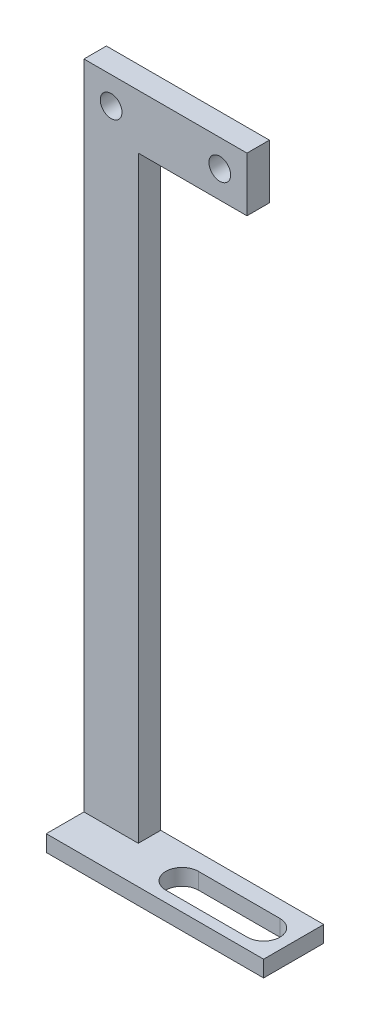
ISO-10303-21;
HEADER;
FILE_DESCRIPTION(('STEP AP214'),'2;1');
FILE_NAME('part.step','',(''),(''),'','','');
FILE_SCHEMA(('AUTOMOTIVE_DESIGN { 1 0 10303 214 1 1 1 1 }'));
ENDSEC;
DATA;
#1=APPLICATION_CONTEXT('core data for automotive mechanical design processes');
#2=APPLICATION_PROTOCOL_DEFINITION('international standard','automotive_design',2000,#1);
#3=PRODUCT_CONTEXT('',#1,'mechanical');
#4=PRODUCT('Part','Part','',(#3));
#5=PRODUCT_RELATED_PRODUCT_CATEGORY('part','',(#4));
#6=PRODUCT_DEFINITION_FORMATION('','',#4);
#7=PRODUCT_DEFINITION_CONTEXT('part definition',#1,'design');
#8=PRODUCT_DEFINITION('design','',#6,#7);
#9=PRODUCT_DEFINITION_SHAPE('','',#8);
#10=(LENGTH_UNIT() NAMED_UNIT(*) SI_UNIT(.MILLI.,.METRE.));
#11=(NAMED_UNIT(*) PLANE_ANGLE_UNIT() SI_UNIT($,.RADIAN.));
#12=(NAMED_UNIT(*) SI_UNIT($,.STERADIAN.) SOLID_ANGLE_UNIT());
#13=UNCERTAINTY_MEASURE_WITH_UNIT(LENGTH_MEASURE(1.E-05),#10,'distance_accuracy_value','');
#14=(GEOMETRIC_REPRESENTATION_CONTEXT(3) GLOBAL_UNCERTAINTY_ASSIGNED_CONTEXT((#13)) GLOBAL_UNIT_ASSIGNED_CONTEXT((#10,
#11,#12)) REPRESENTATION_CONTEXT('',''));
#15=CARTESIAN_POINT('',(0.,0.,0.));
#16=DIRECTION('',(0.,0.,1.));
#17=DIRECTION('',(1.,0.,0.));
#18=AXIS2_PLACEMENT_3D('',#15,#16,#17);
#19=CARTESIAN_POINT('',(-5.,0.,3.06470199150335));
#20=DIRECTION('',(1.,0.,0.));
#21=DIRECTION('',(0.,0.,-1.));
#22=AXIS2_PLACEMENT_3D('',#19,#20,#21);
#23=PLANE('',#22);
#24=DIRECTION('',(0.,1.,0.));
#25=VECTOR('',#24,1.);
#26=CARTESIAN_POINT('',(-5.,0.,-1.06470199150335));
#27=LINE('',#26,#25);
#28=CARTESIAN_POINT('',(-5.,3.,-1.06470199150335));
#29=VERTEX_POINT('',#28);
#30=CARTESIAN_POINT('',(-5.,113.,-1.06470199150335));
#31=VERTEX_POINT('',#30);
#32=EDGE_CURVE('E257',#29,#31,#27,.T.);
#33=ORIENTED_EDGE('',*,*,#32,.T.);
#34=DIRECTION('',(0.,0.,-1.));
#35=VECTOR('',#34,1.);
#36=CARTESIAN_POINT('',(-5.,113.,3.06470199150335));
#37=LINE('',#36,#35);
#38=CARTESIAN_POINT('',(-5.,113.,3.06470199150335));
#39=VERTEX_POINT('',#38);
#40=EDGE_CURVE('E212',#39,#31,#37,.T.);
#41=ORIENTED_EDGE('',*,*,#40,.F.);
#42=DIRECTION('',(0.,1.,0.));
#43=VECTOR('',#42,1.);
#44=CARTESIAN_POINT('',(-5.,0.,3.06470199150335));
#45=LINE('',#44,#43);
#46=CARTESIAN_POINT('',(-5.,3.,3.06470199150335));
#47=VERTEX_POINT('',#46);
#48=EDGE_CURVE('E258',#47,#39,#45,.T.);
#49=ORIENTED_EDGE('',*,*,#48,.F.);
#50=DIRECTION('',(0.,0.,-1.));
#51=VECTOR('',#50,1.);
#52=CARTESIAN_POINT('',(-5.,3.,0.));
#53=LINE('',#52,#51);
#54=EDGE_CURVE('E51',#47,#29,#53,.T.);
#55=ORIENTED_EDGE('',*,*,#54,.T.);
#56=EDGE_LOOP('',(#33,#41,#49,#55));
#57=FACE_BOUND('',#56,.T.);
#58=ADVANCED_FACE('F35',(#57),#23,.T.);
#59=CARTESIAN_POINT('',(0.,3.,10.));
#60=DIRECTION('',(0.,0.,-1.));
#61=DIRECTION('',(-1.,0.,0.));
#62=AXIS2_PLACEMENT_3D('',#59,#60,#61);
#63=PLANE('',#62);
#64=DIRECTION('',(1.,0.,0.));
#65=VECTOR('',#64,1.);
#66=CARTESIAN_POINT('',(0.,0.,10.));
#67=LINE('',#66,#65);
#68=CARTESIAN_POINT('',(-15.,0.,10.));
#69=VERTEX_POINT('',#68);
#70=CARTESIAN_POINT('',(25.,0.,10.));
#71=VERTEX_POINT('',#70);
#72=EDGE_CURVE('E142',#69,#71,#67,.T.);
#73=ORIENTED_EDGE('',*,*,#72,.T.);
#74=DIRECTION('',(0.,-1.,0.));
#75=VECTOR('',#74,1.);
#76=CARTESIAN_POINT('',(25.,3.,10.));
#77=LINE('',#76,#75);
#78=CARTESIAN_POINT('',(25.,3.,10.));
#79=VERTEX_POINT('',#78);
#80=EDGE_CURVE('E11',#79,#71,#77,.T.);
#81=ORIENTED_EDGE('',*,*,#80,.F.);
#82=DIRECTION('',(1.,0.,0.));
#83=VECTOR('',#82,1.);
#84=CARTESIAN_POINT('',(0.,3.,10.));
#85=LINE('',#84,#83);
#86=CARTESIAN_POINT('',(-15.,3.,10.));
#87=VERTEX_POINT('',#86);
#88=EDGE_CURVE('E119',#87,#79,#85,.T.);
#89=ORIENTED_EDGE('',*,*,#88,.F.);
#90=DIRECTION('',(0.,1.,0.));
#91=VECTOR('',#90,1.);
#92=CARTESIAN_POINT('',(-15.,0.,10.));
#93=LINE('',#92,#91);
#94=EDGE_CURVE('E136',#69,#87,#93,.T.);
#95=ORIENTED_EDGE('',*,*,#94,.F.);
#96=EDGE_LOOP('',(#73,#81,#89,#95));
#97=FACE_BOUND('',#96,.T.);
#98=ADVANCED_FACE('F165',(#97),#63,.F.);
#99=CARTESIAN_POINT('',(25.,3.,0.));
#100=DIRECTION('',(-1.,0.,0.));
#101=DIRECTION('',(0.,0.,1.));
#102=AXIS2_PLACEMENT_3D('',#99,#100,#101);
#103=PLANE('',#102);
#104=DIRECTION('',(0.,0.,-1.));
#105=VECTOR('',#104,1.);
#106=CARTESIAN_POINT('',(25.,0.,0.));
#107=LINE('',#106,#105);
#108=CARTESIAN_POINT('',(25.,0.,-1.06470199150335));
#109=VERTEX_POINT('',#108);
#110=EDGE_CURVE('E85',#71,#109,#107,.T.);
#111=ORIENTED_EDGE('',*,*,#110,.T.);
#112=DIRECTION('',(0.,1.,0.));
#113=VECTOR('',#112,1.);
#114=CARTESIAN_POINT('',(25.,3.,-1.06470199150335));
#115=LINE('',#114,#113);
#116=CARTESIAN_POINT('',(25.,3.,-1.06470199150335));
#117=VERTEX_POINT('',#116);
#118=EDGE_CURVE('E235',#109,#117,#115,.T.);
#119=ORIENTED_EDGE('',*,*,#118,.T.);
#120=DIRECTION('',(0.,0.,-1.));
#121=VECTOR('',#120,1.);
#122=CARTESIAN_POINT('',(25.,3.,0.));
#123=LINE('',#122,#121);
#124=EDGE_CURVE('E59',#79,#117,#123,.T.);
#125=ORIENTED_EDGE('',*,*,#124,.F.);
#126=ORIENTED_EDGE('',*,*,#80,.T.);
#127=EDGE_LOOP('',(#111,#119,#125,#126));
#128=FACE_BOUND('',#127,.T.);
#129=ADVANCED_FACE('F171',(#128),#103,.F.);
#130=CARTESIAN_POINT('',(20.,3.,5.));
#131=DIRECTION('',(0.,-1.,0.));
#132=DIRECTION('',(0.,0.,-1.));
#133=AXIS2_PLACEMENT_3D('',#130,#131,#132);
#134=CYLINDRICAL_SURFACE('',#133,3.);
#135=CARTESIAN_POINT('',(20.,0.,5.));
#136=DIRECTION('',(0.,1.,0.));
#137=DIRECTION('',(0.,0.,1.));
#138=AXIS2_PLACEMENT_3D('',#135,#136,#137);
#139=CIRCLE('',#138,3.);
#140=CARTESIAN_POINT('',(20.,0.,8.));
#141=VERTEX_POINT('',#140);
#142=CARTESIAN_POINT('',(20.,0.,2.));
#143=VERTEX_POINT('',#142);
#144=EDGE_CURVE('E132',#141,#143,#139,.T.);
#145=ORIENTED_EDGE('',*,*,#144,.F.);
#146=DIRECTION('',(0.,-1.,0.));
#147=VECTOR('',#146,1.);
#148=CARTESIAN_POINT('',(20.,3.,8.));
#149=LINE('',#148,#147);
#150=CARTESIAN_POINT('',(20.,3.,8.));
#151=VERTEX_POINT('',#150);
#152=EDGE_CURVE('E39',#151,#141,#149,.T.);
#153=ORIENTED_EDGE('',*,*,#152,.F.);
#154=CARTESIAN_POINT('',(20.,3.,5.));
#155=DIRECTION('',(0.,1.,0.));
#156=DIRECTION('',(0.,0.,1.));
#157=AXIS2_PLACEMENT_3D('',#154,#155,#156);
#158=CIRCLE('',#157,3.);
#159=CARTESIAN_POINT('',(20.,3.,2.));
#160=VERTEX_POINT('',#159);
#161=EDGE_CURVE('E126',#151,#160,#158,.T.);
#162=ORIENTED_EDGE('',*,*,#161,.T.);
#163=DIRECTION('',(0.,-1.,0.));
#164=VECTOR('',#163,1.);
#165=CARTESIAN_POINT('',(20.,3.,2.));
#166=LINE('',#165,#164);
#167=EDGE_CURVE('E113',#160,#143,#166,.T.);
#168=ORIENTED_EDGE('',*,*,#167,.T.);
#169=EDGE_LOOP('',(#145,#153,#162,#168));
#170=FACE_BOUND('',#169,.T.);
#171=ADVANCED_FACE('F37',(#170),#134,.F.);
#172=CARTESIAN_POINT('',(0.,3.,8.));
#173=DIRECTION('',(0.,0.,-1.));
#174=DIRECTION('',(-1.,0.,0.));
#175=AXIS2_PLACEMENT_3D('',#172,#173,#174);
#176=PLANE('',#175);
#177=DIRECTION('',(1.,0.,0.));
#178=VECTOR('',#177,1.);
#179=CARTESIAN_POINT('',(0.,0.,8.));
#180=LINE('',#179,#178);
#181=CARTESIAN_POINT('',(5.,0.,8.));
#182=VERTEX_POINT('',#181);
#183=EDGE_CURVE('E135',#182,#141,#180,.T.);
#184=ORIENTED_EDGE('',*,*,#183,.F.);
#185=DIRECTION('',(0.,-1.,0.));
#186=VECTOR('',#185,1.);
#187=CARTESIAN_POINT('',(5.,3.,8.));
#188=LINE('',#187,#186);
#189=CARTESIAN_POINT('',(5.,3.,8.));
#190=VERTEX_POINT('',#189);
#191=EDGE_CURVE('E112',#190,#182,#188,.T.);
#192=ORIENTED_EDGE('',*,*,#191,.F.);
#193=DIRECTION('',(1.,0.,0.));
#194=VECTOR('',#193,1.);
#195=CARTESIAN_POINT('',(0.,3.,8.));
#196=LINE('',#195,#194);
#197=EDGE_CURVE('E124',#190,#151,#196,.T.);
#198=ORIENTED_EDGE('',*,*,#197,.T.);
#199=ORIENTED_EDGE('',*,*,#152,.T.);
#200=EDGE_LOOP('',(#184,#192,#198,#199));
#201=FACE_BOUND('',#200,.T.);
#202=ADVANCED_FACE('F148',(#201),#176,.T.);
#203=CARTESIAN_POINT('',(5.,3.,5.));
#204=DIRECTION('',(0.,-1.,0.));
#205=DIRECTION('',(0.,0.,-1.));
#206=AXIS2_PLACEMENT_3D('',#203,#204,#205);
#207=CYLINDRICAL_SURFACE('',#206,3.);
#208=CARTESIAN_POINT('',(5.,0.,5.));
#209=DIRECTION('',(0.,1.,0.));
#210=DIRECTION('',(0.,0.,1.));
#211=AXIS2_PLACEMENT_3D('',#208,#209,#210);
#212=CIRCLE('',#211,3.);
#213=CARTESIAN_POINT('',(5.,0.,2.));
#214=VERTEX_POINT('',#213);
#215=EDGE_CURVE('E108',#214,#182,#212,.T.);
#216=ORIENTED_EDGE('',*,*,#215,.F.);
#217=DIRECTION('',(0.,-1.,0.));
#218=VECTOR('',#217,1.);
#219=CARTESIAN_POINT('',(5.,3.,2.));
#220=LINE('',#219,#218);
#221=CARTESIAN_POINT('',(5.,3.,2.));
#222=VERTEX_POINT('',#221);
#223=EDGE_CURVE('E102',#222,#214,#220,.T.);
#224=ORIENTED_EDGE('',*,*,#223,.F.);
#225=CARTESIAN_POINT('',(5.,3.,5.));
#226=DIRECTION('',(0.,1.,0.));
#227=DIRECTION('',(0.,0.,1.));
#228=AXIS2_PLACEMENT_3D('',#225,#226,#227);
#229=CIRCLE('',#228,3.);
#230=EDGE_CURVE('E106',#222,#190,#229,.T.);
#231=ORIENTED_EDGE('',*,*,#230,.T.);
#232=ORIENTED_EDGE('',*,*,#191,.T.);
#233=EDGE_LOOP('',(#216,#224,#231,#232));
#234=FACE_BOUND('',#233,.T.);
#235=ADVANCED_FACE('F104',(#234),#207,.F.);
#236=CARTESIAN_POINT('',(0.,3.,2.));
#237=DIRECTION('',(0.,0.,-1.));
#238=DIRECTION('',(-1.,0.,0.));
#239=AXIS2_PLACEMENT_3D('',#236,#237,#238);
#240=PLANE('',#239);
#241=DIRECTION('',(1.,0.,0.));
#242=VECTOR('',#241,1.);
#243=CARTESIAN_POINT('',(0.,0.,2.));
#244=LINE('',#243,#242);
#245=EDGE_CURVE('E140',#214,#143,#244,.T.);
#246=ORIENTED_EDGE('',*,*,#245,.T.);
#247=ORIENTED_EDGE('',*,*,#167,.F.);
#248=DIRECTION('',(1.,0.,0.));
#249=VECTOR('',#248,1.);
#250=CARTESIAN_POINT('',(0.,3.,2.));
#251=LINE('',#250,#249);
#252=EDGE_CURVE('E116',#222,#160,#251,.T.);
#253=ORIENTED_EDGE('',*,*,#252,.F.);
#254=ORIENTED_EDGE('',*,*,#223,.T.);
#255=EDGE_LOOP('',(#246,#247,#253,#254));
#256=FACE_BOUND('',#255,.T.);
#257=ADVANCED_FACE('F117',(#256),#240,.F.);
#258=CARTESIAN_POINT('',(0.,3.,0.));
#259=DIRECTION('',(0.,1.,0.));
#260=DIRECTION('',(0.,0.,1.));
#261=AXIS2_PLACEMENT_3D('',#258,#259,#260);
#262=PLANE('',#261);
#263=ORIENTED_EDGE('',*,*,#54,.F.);
#264=DIRECTION('',(1.,0.,0.));
#265=VECTOR('',#264,1.);
#266=CARTESIAN_POINT('',(0.,3.,3.06470199150335));
#267=LINE('',#266,#265);
#268=CARTESIAN_POINT('',(-15.,3.,3.06470199150335));
#269=VERTEX_POINT('',#268);
#270=EDGE_CURVE('E261',#269,#47,#267,.T.);
#271=ORIENTED_EDGE('',*,*,#270,.F.);
#272=DIRECTION('',(0.,0.,1.));
#273=VECTOR('',#272,1.);
#274=CARTESIAN_POINT('',(-15.,3.,0.));
#275=LINE('',#274,#273);
#276=EDGE_CURVE('E271',#269,#87,#275,.T.);
#277=ORIENTED_EDGE('',*,*,#276,.T.);
#278=ORIENTED_EDGE('',*,*,#88,.T.);
#279=ORIENTED_EDGE('',*,*,#124,.T.);
#280=DIRECTION('',(-1.,0.,0.));
#281=VECTOR('',#280,1.);
#282=CARTESIAN_POINT('',(25.,3.,-1.06470199150335));
#283=LINE('',#282,#281);
#284=EDGE_CURVE('E237',#117,#29,#283,.T.);
#285=ORIENTED_EDGE('',*,*,#284,.T.);
#286=EDGE_LOOP('',(#263,#271,#277,#278,#279,#285));
#287=FACE_BOUND('',#286,.T.);
#288=ORIENTED_EDGE('',*,*,#161,.F.);
#289=ORIENTED_EDGE('',*,*,#197,.F.);
#290=ORIENTED_EDGE('',*,*,#230,.F.);
#291=ORIENTED_EDGE('',*,*,#252,.T.);
#292=EDGE_LOOP('',(#288,#289,#290,#291));
#293=FACE_BOUND('',#292,.T.);
#294=ADVANCED_FACE('F122',(#287,#293),#262,.T.);
#295=CARTESIAN_POINT('',(0.,0.,0.));
#296=DIRECTION('',(0.,1.,0.));
#297=DIRECTION('',(0.,0.,1.));
#298=AXIS2_PLACEMENT_3D('',#295,#296,#297);
#299=PLANE('',#298);
#300=DIRECTION('',(0.,0.,1.));
#301=VECTOR('',#300,1.);
#302=CARTESIAN_POINT('',(-15.,0.,0.));
#303=LINE('',#302,#301);
#304=CARTESIAN_POINT('',(-15.,0.,-1.06470199150335));
#305=VERTEX_POINT('',#304);
#306=EDGE_CURVE('E272',#305,#69,#303,.T.);
#307=ORIENTED_EDGE('',*,*,#306,.F.);
#308=DIRECTION('',(-1.,0.,0.));
#309=VECTOR('',#308,1.);
#310=CARTESIAN_POINT('',(-5.,0.,-1.06470199150335));
#311=LINE('',#310,#309);
#312=EDGE_CURVE('E254',#109,#305,#311,.T.);
#313=ORIENTED_EDGE('',*,*,#312,.F.);
#314=ORIENTED_EDGE('',*,*,#110,.F.);
#315=ORIENTED_EDGE('',*,*,#72,.F.);
#316=EDGE_LOOP('',(#307,#313,#314,#315));
#317=FACE_BOUND('',#316,.T.);
#318=ORIENTED_EDGE('',*,*,#144,.T.);
#319=ORIENTED_EDGE('',*,*,#245,.F.);
#320=ORIENTED_EDGE('',*,*,#215,.T.);
#321=ORIENTED_EDGE('',*,*,#183,.T.);
#322=EDGE_LOOP('',(#318,#319,#320,#321));
#323=FACE_BOUND('',#322,.T.);
#324=ADVANCED_FACE('F150',(#317,#323),#299,.F.);
#325=CARTESIAN_POINT('',(-15.,0.,0.));
#326=DIRECTION('',(-1.,0.,0.));
#327=DIRECTION('',(0.,0.,1.));
#328=AXIS2_PLACEMENT_3D('',#325,#326,#327);
#329=PLANE('',#328);
#330=ORIENTED_EDGE('',*,*,#276,.F.);
#331=DIRECTION('',(0.,1.,0.));
#332=VECTOR('',#331,1.);
#333=CARTESIAN_POINT('',(-15.,0.,3.06470199150335));
#334=LINE('',#333,#332);
#335=CARTESIAN_POINT('',(-15.,123.,3.06470199150335));
#336=VERTEX_POINT('',#335);
#337=EDGE_CURVE('E262',#269,#336,#334,.T.);
#338=ORIENTED_EDGE('',*,*,#337,.T.);
#339=DIRECTION('',(0.,0.,1.));
#340=VECTOR('',#339,1.);
#341=CARTESIAN_POINT('',(-15.,123.,-1.06470199150335));
#342=LINE('',#341,#340);
#343=CARTESIAN_POINT('',(-15.,123.,-1.06470199150335));
#344=VERTEX_POINT('',#343);
#345=EDGE_CURVE('E248',#344,#336,#342,.T.);
#346=ORIENTED_EDGE('',*,*,#345,.F.);
#347=DIRECTION('',(0.,1.,0.));
#348=VECTOR('',#347,1.);
#349=CARTESIAN_POINT('',(-15.,0.,-1.06470199150335));
#350=LINE('',#349,#348);
#351=EDGE_CURVE('E265',#305,#344,#350,.T.);
#352=ORIENTED_EDGE('',*,*,#351,.F.);
#353=ORIENTED_EDGE('',*,*,#306,.T.);
#354=ORIENTED_EDGE('',*,*,#94,.T.);
#355=EDGE_LOOP('',(#330,#338,#346,#352,#353,#354));
#356=FACE_BOUND('',#355,.T.);
#357=ADVANCED_FACE('F152',(#356),#329,.T.);
#358=CARTESIAN_POINT('',(-15.,0.,3.06470199150335));
#359=DIRECTION('',(0.,0.,1.));
#360=DIRECTION('',(1.,0.,0.));
#361=AXIS2_PLACEMENT_3D('',#358,#359,#360);
#362=PLANE('',#361);
#363=CARTESIAN_POINT('',(10.,118.,3.06470199150335));
#364=DIRECTION('',(0.,0.,1.));
#365=DIRECTION('',(1.,0.,0.));
#366=AXIS2_PLACEMENT_3D('',#363,#364,#365);
#367=CIRCLE('',#366,2.);
#368=CARTESIAN_POINT('',(12.,118.,3.06470199150335));
#369=VERTEX_POINT('',#368);
#370=EDGE_CURVE('E210',#369,#369,#367,.T.);
#371=ORIENTED_EDGE('',*,*,#370,.F.);
#372=EDGE_LOOP('',(#371));
#373=FACE_BOUND('',#372,.T.);
#374=CARTESIAN_POINT('',(-10.,118.,3.06470199150335));
#375=DIRECTION('',(0.,0.,1.));
#376=DIRECTION('',(1.,0.,0.));
#377=AXIS2_PLACEMENT_3D('',#374,#375,#376);
#378=CIRCLE('',#377,2.);
#379=CARTESIAN_POINT('',(-8.,118.,3.06470199150335));
#380=VERTEX_POINT('',#379);
#381=EDGE_CURVE('E239',#380,#380,#378,.T.);
#382=ORIENTED_EDGE('',*,*,#381,.F.);
#383=EDGE_LOOP('',(#382));
#384=FACE_BOUND('',#383,.T.);
#385=ORIENTED_EDGE('',*,*,#337,.F.);
#386=ORIENTED_EDGE('',*,*,#270,.T.);
#387=ORIENTED_EDGE('',*,*,#48,.T.);
#388=DIRECTION('',(-1.,0.,0.));
#389=VECTOR('',#388,1.);
#390=CARTESIAN_POINT('',(15.,113.,3.06470199150335));
#391=LINE('',#390,#389);
#392=CARTESIAN_POINT('',(15.,113.,3.06470199150335));
#393=VERTEX_POINT('',#392);
#394=EDGE_CURVE('E232',#393,#39,#391,.T.);
#395=ORIENTED_EDGE('',*,*,#394,.F.);
#396=DIRECTION('',(0.,-1.,0.));
#397=VECTOR('',#396,1.);
#398=CARTESIAN_POINT('',(15.,123.,3.06470199150335));
#399=LINE('',#398,#397);
#400=CARTESIAN_POINT('',(15.,123.,3.06470199150335));
#401=VERTEX_POINT('',#400);
#402=EDGE_CURVE('E218',#401,#393,#399,.T.);
#403=ORIENTED_EDGE('',*,*,#402,.F.);
#404=DIRECTION('',(1.,0.,0.));
#405=VECTOR('',#404,1.);
#406=CARTESIAN_POINT('',(-15.,123.,3.06470199150335));
#407=LINE('',#406,#405);
#408=EDGE_CURVE('E251',#336,#401,#407,.T.);
#409=ORIENTED_EDGE('',*,*,#408,.F.);
#410=EDGE_LOOP('',(#385,#386,#387,#395,#403,#409));
#411=FACE_BOUND('',#410,.T.);
#412=ADVANCED_FACE('F158',(#373,#384,#411),#362,.T.);
#413=CARTESIAN_POINT('',(-5.,0.,-1.06470199150335));
#414=DIRECTION('',(0.,0.,-1.));
#415=DIRECTION('',(-1.,0.,0.));
#416=AXIS2_PLACEMENT_3D('',#413,#414,#415);
#417=PLANE('',#416);
#418=CARTESIAN_POINT('',(10.,118.,-1.06470199150335));
#419=DIRECTION('',(0.,0.,1.));
#420=DIRECTION('',(1.,0.,0.));
#421=AXIS2_PLACEMENT_3D('',#418,#419,#420);
#422=CIRCLE('',#421,2.);
#423=CARTESIAN_POINT('',(12.,118.,-1.06470199150335));
#424=VERTEX_POINT('',#423);
#425=EDGE_CURVE('E207',#424,#424,#422,.T.);
#426=ORIENTED_EDGE('',*,*,#425,.T.);
#427=EDGE_LOOP('',(#426));
#428=FACE_BOUND('',#427,.T.);
#429=CARTESIAN_POINT('',(-10.,118.,-1.06470199150335));
#430=DIRECTION('',(0.,0.,1.));
#431=DIRECTION('',(1.,0.,0.));
#432=AXIS2_PLACEMENT_3D('',#429,#430,#431);
#433=CIRCLE('',#432,2.);
#434=CARTESIAN_POINT('',(-8.,118.,-1.06470199150335));
#435=VERTEX_POINT('',#434);
#436=EDGE_CURVE('E240',#435,#435,#433,.T.);
#437=ORIENTED_EDGE('',*,*,#436,.T.);
#438=EDGE_LOOP('',(#437));
#439=FACE_BOUND('',#438,.T.);
#440=ORIENTED_EDGE('',*,*,#351,.T.);
#441=DIRECTION('',(-1.,0.,0.));
#442=VECTOR('',#441,1.);
#443=CARTESIAN_POINT('',(-5.,123.,-1.06470199150335));
#444=LINE('',#443,#442);
#445=CARTESIAN_POINT('',(15.,123.,-1.06470199150335));
#446=VERTEX_POINT('',#445);
#447=EDGE_CURVE('E243',#446,#344,#444,.T.);
#448=ORIENTED_EDGE('',*,*,#447,.F.);
#449=DIRECTION('',(0.,1.,0.));
#450=VECTOR('',#449,1.);
#451=CARTESIAN_POINT('',(15.,113.,-1.06470199150335));
#452=LINE('',#451,#450);
#453=CARTESIAN_POINT('',(15.,113.,-1.06470199150335));
#454=VERTEX_POINT('',#453);
#455=EDGE_CURVE('E224',#454,#446,#452,.T.);
#456=ORIENTED_EDGE('',*,*,#455,.F.);
#457=DIRECTION('',(-1.,0.,0.));
#458=VECTOR('',#457,1.);
#459=CARTESIAN_POINT('',(15.,113.,-1.06470199150335));
#460=LINE('',#459,#458);
#461=EDGE_CURVE('E227',#454,#31,#460,.T.);
#462=ORIENTED_EDGE('',*,*,#461,.T.);
#463=ORIENTED_EDGE('',*,*,#32,.F.);
#464=ORIENTED_EDGE('',*,*,#284,.F.);
#465=ORIENTED_EDGE('',*,*,#118,.F.);
#466=ORIENTED_EDGE('',*,*,#312,.T.);
#467=EDGE_LOOP('',(#440,#448,#456,#462,#463,#464,#465,#466));
#468=FACE_BOUND('',#467,.T.);
#469=ADVANCED_FACE('F176',(#428,#439,#468),#417,.T.);
#470=CARTESIAN_POINT('',(0.,123.,0.));
#471=DIRECTION('',(0.,1.,0.));
#472=DIRECTION('',(0.,0.,1.));
#473=AXIS2_PLACEMENT_3D('',#470,#471,#472);
#474=PLANE('',#473);
#475=ORIENTED_EDGE('',*,*,#408,.T.);
#476=DIRECTION('',(0.,0.,1.));
#477=VECTOR('',#476,1.);
#478=CARTESIAN_POINT('',(15.,123.,-1.06470199150335));
#479=LINE('',#478,#477);
#480=EDGE_CURVE('E215',#446,#401,#479,.T.);
#481=ORIENTED_EDGE('',*,*,#480,.F.);
#482=ORIENTED_EDGE('',*,*,#447,.T.);
#483=ORIENTED_EDGE('',*,*,#345,.T.);
#484=EDGE_LOOP('',(#475,#481,#482,#483));
#485=FACE_BOUND('',#484,.T.);
#486=ADVANCED_FACE('F179',(#485),#474,.T.);
#487=CARTESIAN_POINT('',(-10.,118.,-1.06470199150335));
#488=DIRECTION('',(0.,0.,1.));
#489=DIRECTION('',(1.,0.,0.));
#490=AXIS2_PLACEMENT_3D('',#487,#488,#489);
#491=CYLINDRICAL_SURFACE('',#490,2.);
#492=ORIENTED_EDGE('',*,*,#436,.F.);
#493=EDGE_LOOP('',(#492));
#494=FACE_BOUND('',#493,.T.);
#495=ORIENTED_EDGE('',*,*,#381,.T.);
#496=EDGE_LOOP('',(#495));
#497=FACE_BOUND('',#496,.T.);
#498=ADVANCED_FACE('F186',(#494,#497),#491,.F.);
#499=CARTESIAN_POINT('',(15.,113.,3.06470199150335));
#500=DIRECTION('',(0.,1.,0.));
#501=DIRECTION('',(0.,0.,1.));
#502=AXIS2_PLACEMENT_3D('',#499,#500,#501);
#503=PLANE('',#502);
#504=ORIENTED_EDGE('',*,*,#40,.T.);
#505=ORIENTED_EDGE('',*,*,#461,.F.);
#506=DIRECTION('',(0.,0.,-1.));
#507=VECTOR('',#506,1.);
#508=CARTESIAN_POINT('',(15.,113.,3.06470199150335));
#509=LINE('',#508,#507);
#510=EDGE_CURVE('E221',#393,#454,#509,.T.);
#511=ORIENTED_EDGE('',*,*,#510,.F.);
#512=ORIENTED_EDGE('',*,*,#394,.T.);
#513=EDGE_LOOP('',(#504,#505,#511,#512));
#514=FACE_BOUND('',#513,.T.);
#515=ADVANCED_FACE('F190',(#514),#503,.F.);
#516=CARTESIAN_POINT('',(15.,0.,0.));
#517=DIRECTION('',(1.,0.,0.));
#518=DIRECTION('',(0.,0.,-1.));
#519=AXIS2_PLACEMENT_3D('',#516,#517,#518);
#520=PLANE('',#519);
#521=ORIENTED_EDGE('',*,*,#480,.T.);
#522=ORIENTED_EDGE('',*,*,#402,.T.);
#523=ORIENTED_EDGE('',*,*,#510,.T.);
#524=ORIENTED_EDGE('',*,*,#455,.T.);
#525=EDGE_LOOP('',(#521,#522,#523,#524));
#526=FACE_BOUND('',#525,.T.);
#527=ADVANCED_FACE('F194',(#526),#520,.T.);
#528=CARTESIAN_POINT('',(10.,118.,-1.06470199150335));
#529=DIRECTION('',(0.,0.,1.));
#530=DIRECTION('',(1.,0.,0.));
#531=AXIS2_PLACEMENT_3D('',#528,#529,#530);
#532=CYLINDRICAL_SURFACE('',#531,2.);
#533=ORIENTED_EDGE('',*,*,#425,.F.);
#534=EDGE_LOOP('',(#533));
#535=FACE_BOUND('',#534,.T.);
#536=ORIENTED_EDGE('',*,*,#370,.T.);
#537=EDGE_LOOP('',(#536));
#538=FACE_BOUND('',#537,.T.);
#539=ADVANCED_FACE('F198',(#535,#538),#532,.F.);
#540=CLOSED_SHELL('',(#58,#98,#129,#171,#202,#235,#257,#294,#324,#357,#412,#469,#486,#498,#515,
#527,#539));
#541=MANIFOLD_SOLID_BREP('B2',#540);
#542=ADVANCED_BREP_SHAPE_REPRESENTATION('',(#18,#541),#14);
#543=SHAPE_DEFINITION_REPRESENTATION(#9,#542);
ENDSEC;
END-ISO-10303-21;
